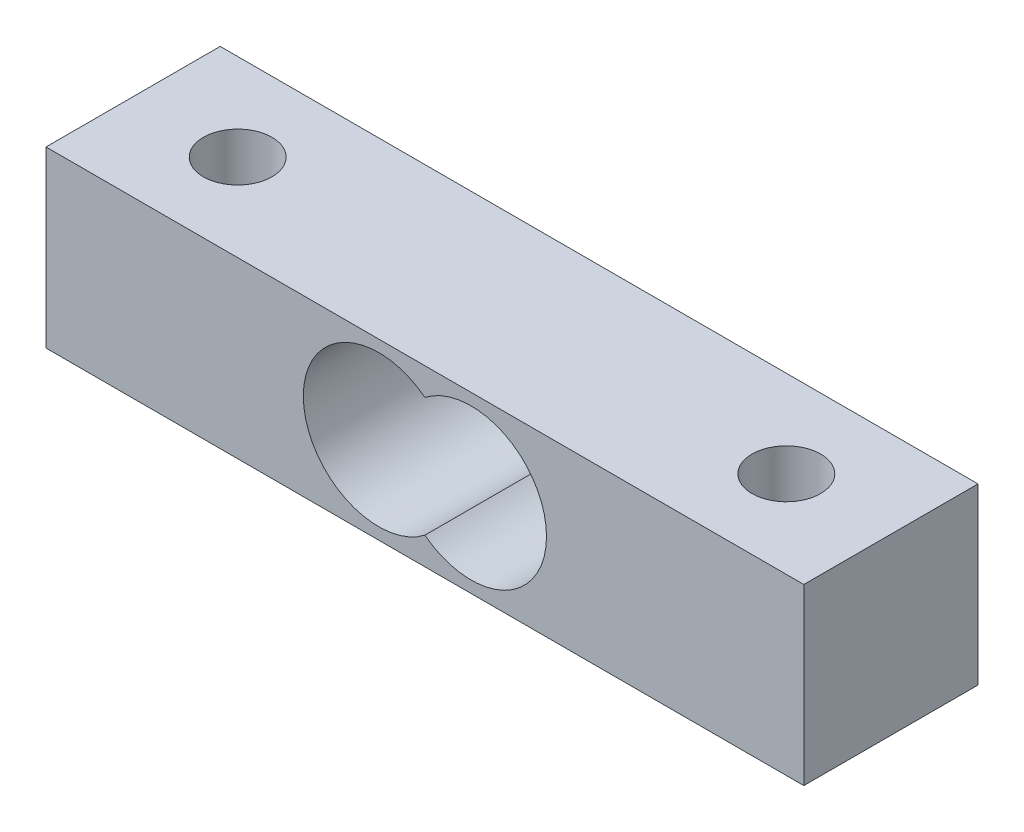
ISO-10303-21;
HEADER;
FILE_DESCRIPTION(('STEP AP214'),'2;1');
FILE_NAME('part.step','',(''),(''),'','','');
FILE_SCHEMA(('AUTOMOTIVE_DESIGN { 1 0 10303 214 1 1 1 1 }'));
ENDSEC;
DATA;
#1=APPLICATION_CONTEXT('core data for automotive mechanical design processes');
#2=APPLICATION_PROTOCOL_DEFINITION('international standard','automotive_design',2000,#1);
#3=PRODUCT_CONTEXT('',#1,'mechanical');
#4=PRODUCT('Part','Part','',(#3));
#5=PRODUCT_RELATED_PRODUCT_CATEGORY('part','',(#4));
#6=PRODUCT_DEFINITION_FORMATION('','',#4);
#7=PRODUCT_DEFINITION_CONTEXT('part definition',#1,'design');
#8=PRODUCT_DEFINITION('design','',#6,#7);
#9=PRODUCT_DEFINITION_SHAPE('','',#8);
#10=(LENGTH_UNIT() NAMED_UNIT(*) SI_UNIT(.MILLI.,.METRE.));
#11=(NAMED_UNIT(*) PLANE_ANGLE_UNIT() SI_UNIT($,.RADIAN.));
#12=(NAMED_UNIT(*) SI_UNIT($,.STERADIAN.) SOLID_ANGLE_UNIT());
#13=UNCERTAINTY_MEASURE_WITH_UNIT(LENGTH_MEASURE(1.E-05),#10,'distance_accuracy_value','');
#14=(GEOMETRIC_REPRESENTATION_CONTEXT(3) GLOBAL_UNCERTAINTY_ASSIGNED_CONTEXT((#13)) GLOBAL_UNIT_ASSIGNED_CONTEXT((#10,
#11,#12)) REPRESENTATION_CONTEXT('',''));
#15=CARTESIAN_POINT('',(0.,0.,0.));
#16=DIRECTION('',(0.,0.,1.));
#17=DIRECTION('',(1.,0.,0.));
#18=AXIS2_PLACEMENT_3D('',#15,#16,#17);
#19=CARTESIAN_POINT('',(0.,0.,12.7));
#20=DIRECTION('',(0.,1.,0.));
#21=DIRECTION('',(0.,0.,1.));
#22=AXIS2_PLACEMENT_3D('',#19,#20,#21);
#23=PLANE('',#22);
#24=DIRECTION('',(1.,0.,0.));
#25=VECTOR('',#24,1.);
#26=CARTESIAN_POINT('',(0.,0.,0.));
#27=LINE('',#26,#25);
#28=CARTESIAN_POINT('',(0.,0.,0.));
#29=VERTEX_POINT('',#28);
#30=CARTESIAN_POINT('',(55.25,0.,0.));
#31=VERTEX_POINT('',#30);
#32=EDGE_CURVE('E138',#29,#31,#27,.T.);
#33=ORIENTED_EDGE('',*,*,#32,.T.);
#34=DIRECTION('',(0.,0.,-1.));
#35=VECTOR('',#34,1.);
#36=CARTESIAN_POINT('',(55.25,0.,12.7));
#37=LINE('',#36,#35);
#38=CARTESIAN_POINT('',(55.25,0.,12.7));
#39=VERTEX_POINT('',#38);
#40=EDGE_CURVE('E108',#39,#31,#37,.T.);
#41=ORIENTED_EDGE('',*,*,#40,.F.);
#42=DIRECTION('',(1.,0.,0.));
#43=VECTOR('',#42,1.);
#44=CARTESIAN_POINT('',(0.,0.,12.7));
#45=LINE('',#44,#43);
#46=CARTESIAN_POINT('',(0.,0.,12.7));
#47=VERTEX_POINT('',#46);
#48=EDGE_CURVE('E79',#47,#39,#45,.T.);
#49=ORIENTED_EDGE('',*,*,#48,.F.);
#50=DIRECTION('',(0.,0.,-1.));
#51=VECTOR('',#50,1.);
#52=CARTESIAN_POINT('',(0.,0.,12.7));
#53=LINE('',#52,#51);
#54=EDGE_CURVE('E11',#47,#29,#53,.T.);
#55=ORIENTED_EDGE('',*,*,#54,.T.);
#56=EDGE_LOOP('',(#33,#41,#49,#55));
#57=FACE_BOUND('',#56,.T.);
#58=CARTESIAN_POINT('',(7.625,0.,6.35));
#59=DIRECTION('',(0.,1.,0.));
#60=DIRECTION('',(0.,0.,1.));
#61=AXIS2_PLACEMENT_3D('',#58,#59,#60);
#62=CIRCLE('',#61,2.5);
#63=CARTESIAN_POINT('',(7.625,0.,8.85));
#64=VERTEX_POINT('',#63);
#65=EDGE_CURVE('E128',#64,#64,#62,.F.);
#66=ORIENTED_EDGE('',*,*,#65,.F.);
#67=EDGE_LOOP('',(#66));
#68=FACE_BOUND('',#67,.T.);
#69=CARTESIAN_POINT('',(47.625,0.,6.35));
#70=DIRECTION('',(0.,1.,0.));
#71=DIRECTION('',(0.,0.,1.));
#72=AXIS2_PLACEMENT_3D('',#69,#70,#71);
#73=CIRCLE('',#72,2.5);
#74=CARTESIAN_POINT('',(47.625,0.,8.85));
#75=VERTEX_POINT('',#74);
#76=EDGE_CURVE('E120',#75,#75,#73,.T.);
#77=ORIENTED_EDGE('',*,*,#76,.T.);
#78=EDGE_LOOP('',(#77));
#79=FACE_BOUND('',#78,.T.);
#80=ADVANCED_FACE('F32',(#57,#68,#79),#23,.F.);
#81=CARTESIAN_POINT('',(0.,12.7,12.7));
#82=DIRECTION('',(0.,-1.,0.));
#83=DIRECTION('',(0.,0.,-1.));
#84=AXIS2_PLACEMENT_3D('',#81,#82,#83);
#85=PLANE('',#84);
#86=DIRECTION('',(-1.,0.,0.));
#87=VECTOR('',#86,1.);
#88=CARTESIAN_POINT('',(0.,12.7,0.));
#89=LINE('',#88,#87);
#90=CARTESIAN_POINT('',(55.25,12.7,0.));
#91=VERTEX_POINT('',#90);
#92=CARTESIAN_POINT('',(0.,12.7,0.));
#93=VERTEX_POINT('',#92);
#94=EDGE_CURVE('E72',#91,#93,#89,.T.);
#95=ORIENTED_EDGE('',*,*,#94,.T.);
#96=DIRECTION('',(0.,0.,-1.));
#97=VECTOR('',#96,1.);
#98=CARTESIAN_POINT('',(0.,12.7,12.7));
#99=LINE('',#98,#97);
#100=CARTESIAN_POINT('',(0.,12.7,12.7));
#101=VERTEX_POINT('',#100);
#102=EDGE_CURVE('E96',#101,#93,#99,.T.);
#103=ORIENTED_EDGE('',*,*,#102,.F.);
#104=DIRECTION('',(-1.,0.,0.));
#105=VECTOR('',#104,1.);
#106=CARTESIAN_POINT('',(0.,12.7,12.7));
#107=LINE('',#106,#105);
#108=CARTESIAN_POINT('',(55.25,12.7,12.7));
#109=VERTEX_POINT('',#108);
#110=EDGE_CURVE('E49',#109,#101,#107,.T.);
#111=ORIENTED_EDGE('',*,*,#110,.F.);
#112=DIRECTION('',(0.,0.,-1.));
#113=VECTOR('',#112,1.);
#114=CARTESIAN_POINT('',(55.25,12.7,12.7));
#115=LINE('',#114,#113);
#116=EDGE_CURVE('E94',#109,#91,#115,.T.);
#117=ORIENTED_EDGE('',*,*,#116,.T.);
#118=EDGE_LOOP('',(#95,#103,#111,#117));
#119=FACE_BOUND('',#118,.T.);
#120=CARTESIAN_POINT('',(7.625,12.7,6.35));
#121=DIRECTION('',(0.,1.,0.));
#122=DIRECTION('',(0.,0.,1.));
#123=AXIS2_PLACEMENT_3D('',#120,#121,#122);
#124=CIRCLE('',#123,2.5);
#125=CARTESIAN_POINT('',(7.625,12.7,8.85));
#126=VERTEX_POINT('',#125);
#127=EDGE_CURVE('E107',#126,#126,#124,.T.);
#128=ORIENTED_EDGE('',*,*,#127,.F.);
#129=EDGE_LOOP('',(#128));
#130=FACE_BOUND('',#129,.T.);
#131=CARTESIAN_POINT('',(47.625,12.7,6.35));
#132=DIRECTION('',(0.,-1.,0.));
#133=DIRECTION('',(0.,0.,1.));
#134=AXIS2_PLACEMENT_3D('',#131,#132,#133);
#135=CIRCLE('',#134,2.5);
#136=CARTESIAN_POINT('',(47.625,12.7,8.85));
#137=VERTEX_POINT('',#136);
#138=EDGE_CURVE('E123',#137,#137,#135,.T.);
#139=ORIENTED_EDGE('',*,*,#138,.T.);
#140=EDGE_LOOP('',(#139));
#141=FACE_BOUND('',#140,.T.);
#142=ADVANCED_FACE('F92',(#119,#130,#141),#85,.F.);
#143=CARTESIAN_POINT('',(0.,0.,12.7));
#144=DIRECTION('',(1.,0.,0.));
#145=DIRECTION('',(0.,0.,-1.));
#146=AXIS2_PLACEMENT_3D('',#143,#144,#145);
#147=PLANE('',#146);
#148=DIRECTION('',(0.,-1.,0.));
#149=VECTOR('',#148,1.);
#150=CARTESIAN_POINT('',(0.,0.,0.));
#151=LINE('',#150,#149);
#152=EDGE_CURVE('E131',#93,#29,#151,.T.);
#153=ORIENTED_EDGE('',*,*,#152,.T.);
#154=ORIENTED_EDGE('',*,*,#54,.F.);
#155=DIRECTION('',(0.,-1.,0.));
#156=VECTOR('',#155,1.);
#157=CARTESIAN_POINT('',(0.,0.,12.7));
#158=LINE('',#157,#156);
#159=EDGE_CURVE('E132',#101,#47,#158,.T.);
#160=ORIENTED_EDGE('',*,*,#159,.F.);
#161=ORIENTED_EDGE('',*,*,#102,.T.);
#162=EDGE_LOOP('',(#153,#154,#160,#161));
#163=FACE_BOUND('',#162,.T.);
#164=ADVANCED_FACE('F34',(#163),#147,.F.);
#165=CARTESIAN_POINT('',(24.2593648444907,6.35,12.7));
#166=DIRECTION('',(0.,0.,-1.));
#167=DIRECTION('',(-1.,0.,0.));
#168=AXIS2_PLACEMENT_3D('',#165,#166,#167);
#169=CYLINDRICAL_SURFACE('',#168,5.5);
#170=CARTESIAN_POINT('',(24.2593648444907,6.35,0.));
#171=DIRECTION('',(0.,0.,-1.));
#172=DIRECTION('',(1.,0.,0.));
#173=AXIS2_PLACEMENT_3D('',#170,#171,#172);
#174=CIRCLE('',#173,5.5);
#175=CARTESIAN_POINT('',(27.625,2.,0.));
#176=VERTEX_POINT('',#175);
#177=CARTESIAN_POINT('',(27.625,10.7,0.));
#178=VERTEX_POINT('',#177);
#179=EDGE_CURVE('E65',#176,#178,#174,.T.);
#180=ORIENTED_EDGE('',*,*,#179,.T.);
#181=DIRECTION('',(0.,0.,-1.));
#182=VECTOR('',#181,1.);
#183=CARTESIAN_POINT('',(27.625,10.7,12.7));
#184=LINE('',#183,#182);
#185=CARTESIAN_POINT('',(27.625,10.7,12.7));
#186=VERTEX_POINT('',#185);
#187=EDGE_CURVE('E143',#186,#178,#184,.T.);
#188=ORIENTED_EDGE('',*,*,#187,.F.);
#189=CARTESIAN_POINT('',(24.2593648444907,6.35,12.7));
#190=DIRECTION('',(0.,0.,-1.));
#191=DIRECTION('',(1.,0.,0.));
#192=AXIS2_PLACEMENT_3D('',#189,#190,#191);
#193=CIRCLE('',#192,5.5);
#194=CARTESIAN_POINT('',(27.625,2.,12.7));
#195=VERTEX_POINT('',#194);
#196=EDGE_CURVE('E98',#195,#186,#193,.T.);
#197=ORIENTED_EDGE('',*,*,#196,.F.);
#198=DIRECTION('',(0.,0.,-1.));
#199=VECTOR('',#198,1.);
#200=CARTESIAN_POINT('',(27.625,2.,12.7));
#201=LINE('',#200,#199);
#202=EDGE_CURVE('E41',#195,#176,#201,.T.);
#203=ORIENTED_EDGE('',*,*,#202,.T.);
#204=EDGE_LOOP('',(#180,#188,#197,#203));
#205=FACE_BOUND('',#204,.T.);
#206=ADVANCED_FACE('F146',(#205),#169,.F.);
#207=CARTESIAN_POINT('',(24.2593648444907,6.35,12.7));
#208=DIRECTION('',(0.,0.,1.));
#209=DIRECTION('',(1.,0.,0.));
#210=AXIS2_PLACEMENT_3D('',#207,#208,#209);
#211=PLANE('',#210);
#212=DIRECTION('',(0.,-1.,0.));
#213=VECTOR('',#212,1.);
#214=CARTESIAN_POINT('',(55.25,0.,12.7));
#215=LINE('',#214,#213);
#216=EDGE_CURVE('E104',#109,#39,#215,.T.);
#217=ORIENTED_EDGE('',*,*,#216,.F.);
#218=ORIENTED_EDGE('',*,*,#110,.T.);
#219=ORIENTED_EDGE('',*,*,#159,.T.);
#220=ORIENTED_EDGE('',*,*,#48,.T.);
#221=EDGE_LOOP('',(#217,#218,#219,#220));
#222=FACE_BOUND('',#221,.T.);
#223=ORIENTED_EDGE('',*,*,#196,.T.);
#224=CARTESIAN_POINT('',(30.9906351555093,6.35,12.7));
#225=DIRECTION('',(0.,0.,1.));
#226=DIRECTION('',(-1.,0.,0.));
#227=AXIS2_PLACEMENT_3D('',#224,#225,#226);
#228=CIRCLE('',#227,5.5);
#229=EDGE_CURVE('E112',#195,#186,#228,.T.);
#230=ORIENTED_EDGE('',*,*,#229,.F.);
#231=EDGE_LOOP('',(#223,#230));
#232=FACE_BOUND('',#231,.T.);
#233=ADVANCED_FACE('F110',(#222,#232),#211,.T.);
#234=CARTESIAN_POINT('',(24.2593648444907,6.35,0.));
#235=DIRECTION('',(0.,0.,1.));
#236=DIRECTION('',(1.,0.,0.));
#237=AXIS2_PLACEMENT_3D('',#234,#235,#236);
#238=PLANE('',#237);
#239=ORIENTED_EDGE('',*,*,#94,.F.);
#240=DIRECTION('',(0.,-1.,0.));
#241=VECTOR('',#240,1.);
#242=CARTESIAN_POINT('',(55.25,0.,0.));
#243=LINE('',#242,#241);
#244=EDGE_CURVE('E106',#91,#31,#243,.T.);
#245=ORIENTED_EDGE('',*,*,#244,.T.);
#246=ORIENTED_EDGE('',*,*,#32,.F.);
#247=ORIENTED_EDGE('',*,*,#152,.F.);
#248=EDGE_LOOP('',(#239,#245,#246,#247));
#249=FACE_BOUND('',#248,.T.);
#250=CARTESIAN_POINT('',(30.9906351555093,6.35,0.));
#251=DIRECTION('',(0.,0.,1.));
#252=DIRECTION('',(-1.,0.,0.));
#253=AXIS2_PLACEMENT_3D('',#250,#251,#252);
#254=CIRCLE('',#253,5.5);
#255=EDGE_CURVE('E113',#176,#178,#254,.T.);
#256=ORIENTED_EDGE('',*,*,#255,.T.);
#257=ORIENTED_EDGE('',*,*,#179,.F.);
#258=EDGE_LOOP('',(#256,#257));
#259=FACE_BOUND('',#258,.T.);
#260=ADVANCED_FACE('F151',(#249,#259),#238,.F.);
#261=CARTESIAN_POINT('',(7.625,-0.000999999999999265,6.35));
#262=DIRECTION('',(0.,1.,0.));
#263=DIRECTION('',(0.,0.,1.));
#264=AXIS2_PLACEMENT_3D('',#261,#262,#263);
#265=CYLINDRICAL_SURFACE('',#264,2.5);
#266=ORIENTED_EDGE('',*,*,#127,.T.);
#267=EDGE_LOOP('',(#266));
#268=FACE_BOUND('',#267,.T.);
#269=ORIENTED_EDGE('',*,*,#65,.T.);
#270=EDGE_LOOP('',(#269));
#271=FACE_BOUND('',#270,.T.);
#272=ADVANCED_FACE('F153',(#268,#271),#265,.F.);
#273=CARTESIAN_POINT('',(55.25,0.,12.7));
#274=DIRECTION('',(1.,0.,0.));
#275=DIRECTION('',(0.,0.,-1.));
#276=AXIS2_PLACEMENT_3D('',#273,#274,#275);
#277=PLANE('',#276);
#278=ORIENTED_EDGE('',*,*,#244,.F.);
#279=ORIENTED_EDGE('',*,*,#116,.F.);
#280=ORIENTED_EDGE('',*,*,#216,.T.);
#281=ORIENTED_EDGE('',*,*,#40,.T.);
#282=EDGE_LOOP('',(#278,#279,#280,#281));
#283=FACE_BOUND('',#282,.T.);
#284=ADVANCED_FACE('F102',(#283),#277,.T.);
#285=CARTESIAN_POINT('',(30.9906351555093,6.35,12.7));
#286=DIRECTION('',(0.,0.,-1.));
#287=DIRECTION('',(-1.,0.,0.));
#288=AXIS2_PLACEMENT_3D('',#285,#286,#287);
#289=CYLINDRICAL_SURFACE('',#288,5.5);
#290=ORIENTED_EDGE('',*,*,#255,.F.);
#291=ORIENTED_EDGE('',*,*,#202,.F.);
#292=ORIENTED_EDGE('',*,*,#229,.T.);
#293=ORIENTED_EDGE('',*,*,#187,.T.);
#294=EDGE_LOOP('',(#290,#291,#292,#293));
#295=FACE_BOUND('',#294,.T.);
#296=ADVANCED_FACE('F149',(#295),#289,.F.);
#297=CARTESIAN_POINT('',(47.625,-0.000999999999999265,6.35));
#298=DIRECTION('',(0.,1.,0.));
#299=DIRECTION('',(0.,0.,1.));
#300=AXIS2_PLACEMENT_3D('',#297,#298,#299);
#301=CYLINDRICAL_SURFACE('',#300,2.5);
#302=ORIENTED_EDGE('',*,*,#138,.F.);
#303=EDGE_LOOP('',(#302));
#304=FACE_BOUND('',#303,.T.);
#305=ORIENTED_EDGE('',*,*,#76,.F.);
#306=EDGE_LOOP('',(#305));
#307=FACE_BOUND('',#306,.T.);
#308=ADVANCED_FACE('F222',(#304,#307),#301,.F.);
#309=CLOSED_SHELL('',(#80,#142,#164,#206,#233,#260,#272,#284,#296,#308));
#310=MANIFOLD_SOLID_BREP('B2',#309);
#311=ADVANCED_BREP_SHAPE_REPRESENTATION('',(#18,#310),#14);
#312=SHAPE_DEFINITION_REPRESENTATION(#9,#311);
ENDSEC;
END-ISO-10303-21;
